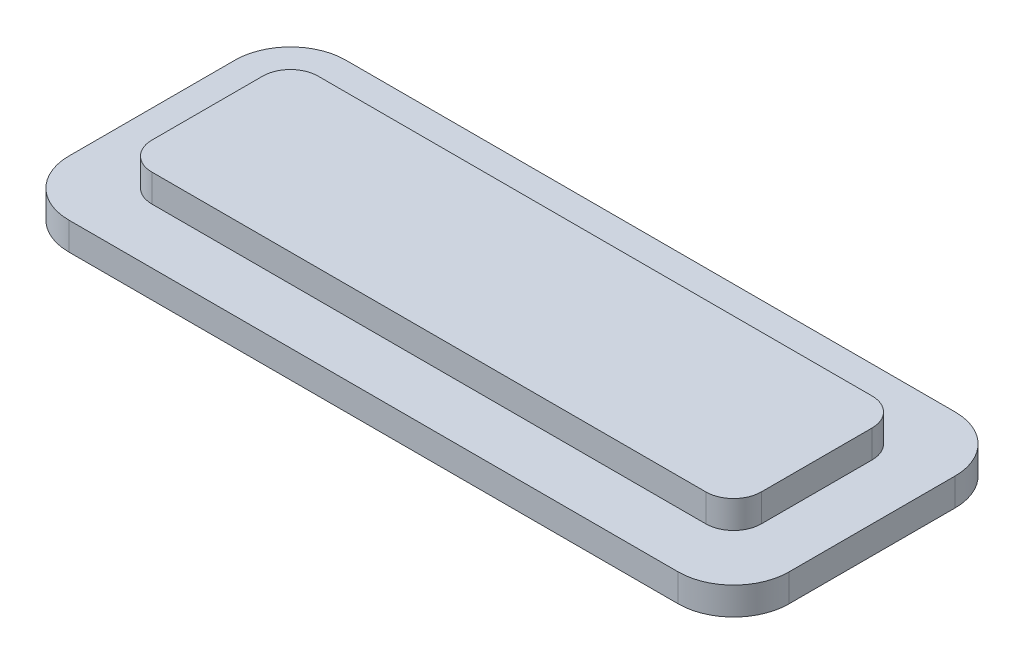
ISO-10303-21;
HEADER;
FILE_DESCRIPTION(('STEP AP214'),'2;1');
FILE_NAME('part.step','',(''),(''),'','','');
FILE_SCHEMA(('AUTOMOTIVE_DESIGN { 1 0 10303 214 1 1 1 1 }'));
ENDSEC;
DATA;
#1=APPLICATION_CONTEXT('core data for automotive mechanical design processes');
#2=APPLICATION_PROTOCOL_DEFINITION('international standard','automotive_design',2000,#1);
#3=PRODUCT_CONTEXT('',#1,'mechanical');
#4=PRODUCT('Part','Part','',(#3));
#5=PRODUCT_RELATED_PRODUCT_CATEGORY('part','',(#4));
#6=PRODUCT_DEFINITION_FORMATION('','',#4);
#7=PRODUCT_DEFINITION_CONTEXT('part definition',#1,'design');
#8=PRODUCT_DEFINITION('design','',#6,#7);
#9=PRODUCT_DEFINITION_SHAPE('','',#8);
#10=(LENGTH_UNIT() NAMED_UNIT(*) SI_UNIT(.MILLI.,.METRE.));
#11=(NAMED_UNIT(*) PLANE_ANGLE_UNIT() SI_UNIT($,.RADIAN.));
#12=(NAMED_UNIT(*) SI_UNIT($,.STERADIAN.) SOLID_ANGLE_UNIT());
#13=UNCERTAINTY_MEASURE_WITH_UNIT(LENGTH_MEASURE(1.E-05),#10,'distance_accuracy_value','');
#14=(GEOMETRIC_REPRESENTATION_CONTEXT(3) GLOBAL_UNCERTAINTY_ASSIGNED_CONTEXT((#13)) GLOBAL_UNIT_ASSIGNED_CONTEXT((#10,
#11,#12)) REPRESENTATION_CONTEXT('',''));
#15=CARTESIAN_POINT('',(0.,0.,0.));
#16=DIRECTION('',(0.,0.,1.));
#17=DIRECTION('',(1.,0.,0.));
#18=AXIS2_PLACEMENT_3D('',#15,#16,#17);
#19=CARTESIAN_POINT('',(11.,1.,3.));
#20=DIRECTION('',(0.,0.,1.));
#21=DIRECTION('',(1.,0.,0.));
#22=AXIS2_PLACEMENT_3D('',#19,#20,#21);
#23=PLANE('',#22);
#24=DIRECTION('',(-1.,0.,0.));
#25=VECTOR('',#24,1.);
#26=CARTESIAN_POINT('',(11.,0.,3.));
#27=LINE('',#26,#25);
#28=CARTESIAN_POINT('',(10.,0.,3.));
#29=VERTEX_POINT('',#28);
#30=CARTESIAN_POINT('',(-10.,0.,3.));
#31=VERTEX_POINT('',#30);
#32=EDGE_CURVE('E183',#29,#31,#27,.T.);
#33=ORIENTED_EDGE('',*,*,#32,.F.);
#34=DIRECTION('',(0.,-1.,0.));
#35=VECTOR('',#34,1.);
#36=CARTESIAN_POINT('',(10.,1.,3.));
#37=LINE('',#36,#35);
#38=CARTESIAN_POINT('',(10.,1.,3.));
#39=VERTEX_POINT('',#38);
#40=EDGE_CURVE('E249',#29,#39,#37,.F.);
#41=ORIENTED_EDGE('',*,*,#40,.T.);
#42=DIRECTION('',(-1.,0.,0.));
#43=VECTOR('',#42,1.);
#44=CARTESIAN_POINT('',(11.,1.,3.));
#45=LINE('',#44,#43);
#46=CARTESIAN_POINT('',(-10.,1.,3.));
#47=VERTEX_POINT('',#46);
#48=EDGE_CURVE('E193',#39,#47,#45,.T.);
#49=ORIENTED_EDGE('',*,*,#48,.T.);
#50=DIRECTION('',(0.,-1.,0.));
#51=VECTOR('',#50,1.);
#52=CARTESIAN_POINT('',(-10.,0.,3.));
#53=LINE('',#52,#51);
#54=EDGE_CURVE('E245',#47,#31,#53,.T.);
#55=ORIENTED_EDGE('',*,*,#54,.T.);
#56=EDGE_LOOP('',(#33,#41,#49,#55));
#57=FACE_BOUND('',#56,.T.);
#58=ADVANCED_FACE('F42',(#57),#23,.T.);
#59=CARTESIAN_POINT('',(11.,1.,-3.));
#60=DIRECTION('',(1.,0.,0.));
#61=DIRECTION('',(0.,0.,-1.));
#62=AXIS2_PLACEMENT_3D('',#59,#60,#61);
#63=PLANE('',#62);
#64=DIRECTION('',(0.,0.,1.));
#65=VECTOR('',#64,1.);
#66=CARTESIAN_POINT('',(11.,0.,-3.));
#67=LINE('',#66,#65);
#68=CARTESIAN_POINT('',(11.,0.,-2.));
#69=VERTEX_POINT('',#68);
#70=CARTESIAN_POINT('',(11.,0.,2.));
#71=VERTEX_POINT('',#70);
#72=EDGE_CURVE('E198',#69,#71,#67,.T.);
#73=ORIENTED_EDGE('',*,*,#72,.F.);
#74=DIRECTION('',(0.,-1.,0.));
#75=VECTOR('',#74,1.);
#76=CARTESIAN_POINT('',(11.,1.,-2.));
#77=LINE('',#76,#75);
#78=CARTESIAN_POINT('',(11.,1.,-2.));
#79=VERTEX_POINT('',#78);
#80=EDGE_CURVE('E230',#69,#79,#77,.F.);
#81=ORIENTED_EDGE('',*,*,#80,.T.);
#82=DIRECTION('',(0.,0.,1.));
#83=VECTOR('',#82,1.);
#84=CARTESIAN_POINT('',(11.,1.,-3.));
#85=LINE('',#84,#83);
#86=CARTESIAN_POINT('',(11.,1.,2.));
#87=VERTEX_POINT('',#86);
#88=EDGE_CURVE('E206',#79,#87,#85,.T.);
#89=ORIENTED_EDGE('',*,*,#88,.T.);
#90=DIRECTION('',(0.,-1.,0.));
#91=VECTOR('',#90,1.);
#92=CARTESIAN_POINT('',(11.,1.,2.));
#93=LINE('',#92,#91);
#94=EDGE_CURVE('E226',#87,#71,#93,.T.);
#95=ORIENTED_EDGE('',*,*,#94,.T.);
#96=EDGE_LOOP('',(#73,#81,#89,#95));
#97=FACE_BOUND('',#96,.T.);
#98=ADVANCED_FACE('F294',(#97),#63,.T.);
#99=CARTESIAN_POINT('',(11.,1.,-3.));
#100=DIRECTION('',(0.,0.,1.));
#101=DIRECTION('',(1.,0.,0.));
#102=AXIS2_PLACEMENT_3D('',#99,#100,#101);
#103=PLANE('',#102);
#104=DIRECTION('',(-1.,0.,0.));
#105=VECTOR('',#104,1.);
#106=CARTESIAN_POINT('',(11.,1.,-3.));
#107=LINE('',#106,#105);
#108=CARTESIAN_POINT('',(10.,1.,-3.));
#109=VERTEX_POINT('',#108);
#110=CARTESIAN_POINT('',(-10.,1.,-3.));
#111=VERTEX_POINT('',#110);
#112=EDGE_CURVE('E202',#109,#111,#107,.T.);
#113=ORIENTED_EDGE('',*,*,#112,.F.);
#114=DIRECTION('',(0.,-1.,0.));
#115=VECTOR('',#114,1.);
#116=CARTESIAN_POINT('',(10.,0.,-3.));
#117=LINE('',#116,#115);
#118=CARTESIAN_POINT('',(10.,0.,-3.));
#119=VERTEX_POINT('',#118);
#120=EDGE_CURVE('E222',#109,#119,#117,.T.);
#121=ORIENTED_EDGE('',*,*,#120,.T.);
#122=DIRECTION('',(-1.,0.,0.));
#123=VECTOR('',#122,1.);
#124=CARTESIAN_POINT('',(11.,0.,-3.));
#125=LINE('',#124,#123);
#126=CARTESIAN_POINT('',(-10.,0.,-3.));
#127=VERTEX_POINT('',#126);
#128=EDGE_CURVE('E213',#119,#127,#125,.T.);
#129=ORIENTED_EDGE('',*,*,#128,.T.);
#130=DIRECTION('',(0.,-1.,0.));
#131=VECTOR('',#130,1.);
#132=CARTESIAN_POINT('',(-10.,1.,-3.));
#133=LINE('',#132,#131);
#134=EDGE_CURVE('E209',#127,#111,#133,.F.);
#135=ORIENTED_EDGE('',*,*,#134,.T.);
#136=EDGE_LOOP('',(#113,#121,#129,#135));
#137=FACE_BOUND('',#136,.T.);
#138=ADVANCED_FACE('F269',(#137),#103,.F.);
#139=CARTESIAN_POINT('',(-11.,1.,-3.));
#140=DIRECTION('',(1.,0.,0.));
#141=DIRECTION('',(0.,0.,-1.));
#142=AXIS2_PLACEMENT_3D('',#139,#140,#141);
#143=PLANE('',#142);
#144=DIRECTION('',(0.,0.,1.));
#145=VECTOR('',#144,1.);
#146=CARTESIAN_POINT('',(-11.,1.,-3.));
#147=LINE('',#146,#145);
#148=CARTESIAN_POINT('',(-11.,1.,-2.));
#149=VERTEX_POINT('',#148);
#150=CARTESIAN_POINT('',(-11.,1.,2.));
#151=VERTEX_POINT('',#150);
#152=EDGE_CURVE('E197',#149,#151,#147,.T.);
#153=ORIENTED_EDGE('',*,*,#152,.F.);
#154=DIRECTION('',(0.,-1.,0.));
#155=VECTOR('',#154,1.);
#156=CARTESIAN_POINT('',(-11.,1.,-2.));
#157=LINE('',#156,#155);
#158=CARTESIAN_POINT('',(-11.,0.,-2.));
#159=VERTEX_POINT('',#158);
#160=EDGE_CURVE('E255',#149,#159,#157,.T.);
#161=ORIENTED_EDGE('',*,*,#160,.T.);
#162=DIRECTION('',(0.,0.,1.));
#163=VECTOR('',#162,1.);
#164=CARTESIAN_POINT('',(-11.,0.,-3.));
#165=LINE('',#164,#163);
#166=CARTESIAN_POINT('',(-11.,0.,2.));
#167=VERTEX_POINT('',#166);
#168=EDGE_CURVE('E187',#159,#167,#165,.T.);
#169=ORIENTED_EDGE('',*,*,#168,.T.);
#170=DIRECTION('',(0.,-1.,0.));
#171=VECTOR('',#170,1.);
#172=CARTESIAN_POINT('',(-11.,1.,2.));
#173=LINE('',#172,#171);
#174=EDGE_CURVE('E252',#167,#151,#173,.F.);
#175=ORIENTED_EDGE('',*,*,#174,.T.);
#176=EDGE_LOOP('',(#153,#161,#169,#175));
#177=FACE_BOUND('',#176,.T.);
#178=ADVANCED_FACE('F279',(#177),#143,.F.);
#179=CARTESIAN_POINT('',(0.,1.,0.));
#180=DIRECTION('',(0.,1.,0.));
#181=DIRECTION('',(0.,0.,1.));
#182=AXIS2_PLACEMENT_3D('',#179,#180,#181);
#183=PLANE('',#182);
#184=ORIENTED_EDGE('',*,*,#88,.F.);
#185=CARTESIAN_POINT('',(10.,1.,-2.));
#186=DIRECTION('',(0.,1.,0.));
#187=DIRECTION('',(0.,0.,1.));
#188=AXIS2_PLACEMENT_3D('',#185,#186,#187);
#189=CIRCLE('',#188,1.);
#190=EDGE_CURVE('E242',#79,#109,#189,.T.);
#191=ORIENTED_EDGE('',*,*,#190,.T.);
#192=ORIENTED_EDGE('',*,*,#112,.T.);
#193=CARTESIAN_POINT('',(-10.,1.,-2.));
#194=DIRECTION('',(0.,1.,0.));
#195=DIRECTION('',(0.,0.,1.));
#196=AXIS2_PLACEMENT_3D('',#193,#194,#195);
#197=CIRCLE('',#196,1.);
#198=EDGE_CURVE('E236',#111,#149,#197,.T.);
#199=ORIENTED_EDGE('',*,*,#198,.T.);
#200=ORIENTED_EDGE('',*,*,#152,.T.);
#201=CARTESIAN_POINT('',(-10.,1.,2.));
#202=DIRECTION('',(0.,1.,0.));
#203=DIRECTION('',(0.,0.,1.));
#204=AXIS2_PLACEMENT_3D('',#201,#202,#203);
#205=CIRCLE('',#204,1.);
#206=EDGE_CURVE('E233',#151,#47,#205,.T.);
#207=ORIENTED_EDGE('',*,*,#206,.T.);
#208=ORIENTED_EDGE('',*,*,#48,.F.);
#209=CARTESIAN_POINT('',(10.,1.,2.));
#210=DIRECTION('',(0.,1.,0.));
#211=DIRECTION('',(0.,0.,1.));
#212=AXIS2_PLACEMENT_3D('',#209,#210,#211);
#213=CIRCLE('',#212,1.);
#214=EDGE_CURVE('E239',#39,#87,#213,.T.);
#215=ORIENTED_EDGE('',*,*,#214,.T.);
#216=EDGE_LOOP('',(#184,#191,#192,#199,#200,#207,#208,#215));
#217=FACE_BOUND('',#216,.T.);
#218=ADVANCED_FACE('F276',(#217),#183,.T.);
#219=CARTESIAN_POINT('',(11.,-1.,3.));
#220=DIRECTION('',(0.,1.,0.));
#221=DIRECTION('',(0.,0.,1.));
#222=AXIS2_PLACEMENT_3D('',#219,#220,#221);
#223=CYLINDRICAL_SURFACE('',#222,2.);
#224=CARTESIAN_POINT('',(11.,0.,3.));
#225=DIRECTION('',(0.,-1.,0.));
#226=DIRECTION('',(0.,0.,1.));
#227=AXIS2_PLACEMENT_3D('',#224,#225,#226);
#228=CIRCLE('',#227,2.);
#229=CARTESIAN_POINT('',(13.,0.,2.99999999999999));
#230=VERTEX_POINT('',#229);
#231=CARTESIAN_POINT('',(11.,0.,5.));
#232=VERTEX_POINT('',#231);
#233=EDGE_CURVE('E181',#230,#232,#228,.T.);
#234=ORIENTED_EDGE('',*,*,#233,.T.);
#235=DIRECTION('',(0.,1.,0.));
#236=VECTOR('',#235,1.);
#237=CARTESIAN_POINT('',(11.,-1.,5.));
#238=LINE('',#237,#236);
#239=CARTESIAN_POINT('',(11.,-1.,5.));
#240=VERTEX_POINT('',#239);
#241=EDGE_CURVE('E159',#240,#232,#238,.T.);
#242=ORIENTED_EDGE('',*,*,#241,.F.);
#243=CARTESIAN_POINT('',(11.,-1.,3.));
#244=DIRECTION('',(0.,-1.,0.));
#245=DIRECTION('',(0.,0.,1.));
#246=AXIS2_PLACEMENT_3D('',#243,#244,#245);
#247=CIRCLE('',#246,2.);
#248=CARTESIAN_POINT('',(13.,-1.,2.99999999999999));
#249=VERTEX_POINT('',#248);
#250=EDGE_CURVE('E167',#249,#240,#247,.T.);
#251=ORIENTED_EDGE('',*,*,#250,.F.);
#252=DIRECTION('',(0.,1.,0.));
#253=VECTOR('',#252,1.);
#254=CARTESIAN_POINT('',(13.,-1.,2.99999999999999));
#255=LINE('',#254,#253);
#256=EDGE_CURVE('E500',#249,#230,#255,.T.);
#257=ORIENTED_EDGE('',*,*,#256,.T.);
#258=EDGE_LOOP('',(#234,#242,#251,#257));
#259=FACE_BOUND('',#258,.T.);
#260=ADVANCED_FACE('F179',(#259),#223,.T.);
#261=CARTESIAN_POINT('',(11.,-1.,5.));
#262=DIRECTION('',(0.,0.,-1.));
#263=DIRECTION('',(-1.,0.,0.));
#264=AXIS2_PLACEMENT_3D('',#261,#262,#263);
#265=PLANE('',#264);
#266=DIRECTION('',(-1.,0.,0.));
#267=VECTOR('',#266,1.);
#268=CARTESIAN_POINT('',(11.,0.,5.));
#269=LINE('',#268,#267);
#270=CARTESIAN_POINT('',(-11.,0.,5.));
#271=VERTEX_POINT('',#270);
#272=EDGE_CURVE('E510',#232,#271,#269,.T.);
#273=ORIENTED_EDGE('',*,*,#272,.T.);
#274=DIRECTION('',(0.,1.,0.));
#275=VECTOR('',#274,1.);
#276=CARTESIAN_POINT('',(-11.,-1.,5.));
#277=LINE('',#276,#275);
#278=CARTESIAN_POINT('',(-11.,-1.,5.));
#279=VERTEX_POINT('',#278);
#280=EDGE_CURVE('E162',#279,#271,#277,.T.);
#281=ORIENTED_EDGE('',*,*,#280,.F.);
#282=DIRECTION('',(-1.,0.,0.));
#283=VECTOR('',#282,1.);
#284=CARTESIAN_POINT('',(11.,-1.,5.));
#285=LINE('',#284,#283);
#286=EDGE_CURVE('E155',#240,#279,#285,.T.);
#287=ORIENTED_EDGE('',*,*,#286,.F.);
#288=ORIENTED_EDGE('',*,*,#241,.T.);
#289=EDGE_LOOP('',(#273,#281,#287,#288));
#290=FACE_BOUND('',#289,.T.);
#291=ADVANCED_FACE('F157',(#290),#265,.F.);
#292=CARTESIAN_POINT('',(-11.,-1.,3.));
#293=DIRECTION('',(0.,1.,0.));
#294=DIRECTION('',(0.,0.,1.));
#295=AXIS2_PLACEMENT_3D('',#292,#293,#294);
#296=CYLINDRICAL_SURFACE('',#295,2.);
#297=CARTESIAN_POINT('',(-11.,0.,3.));
#298=DIRECTION('',(0.,-1.,0.));
#299=DIRECTION('',(0.,0.,-1.));
#300=AXIS2_PLACEMENT_3D('',#297,#298,#299);
#301=CIRCLE('',#300,2.);
#302=CARTESIAN_POINT('',(-13.,0.,2.99999999999999));
#303=VERTEX_POINT('',#302);
#304=EDGE_CURVE('E514',#271,#303,#301,.T.);
#305=ORIENTED_EDGE('',*,*,#304,.T.);
#306=DIRECTION('',(0.,1.,0.));
#307=VECTOR('',#306,1.);
#308=CARTESIAN_POINT('',(-13.,-1.,2.99999999999999));
#309=LINE('',#308,#307);
#310=CARTESIAN_POINT('',(-13.,-1.,2.99999999999999));
#311=VERTEX_POINT('',#310);
#312=EDGE_CURVE('E189',#311,#303,#309,.T.);
#313=ORIENTED_EDGE('',*,*,#312,.F.);
#314=CARTESIAN_POINT('',(-11.,-1.,3.));
#315=DIRECTION('',(0.,-1.,0.));
#316=DIRECTION('',(0.,0.,-1.));
#317=AXIS2_PLACEMENT_3D('',#314,#315,#316);
#318=CIRCLE('',#317,2.);
#319=EDGE_CURVE('E166',#279,#311,#318,.T.);
#320=ORIENTED_EDGE('',*,*,#319,.F.);
#321=ORIENTED_EDGE('',*,*,#280,.T.);
#322=EDGE_LOOP('',(#305,#313,#320,#321));
#323=FACE_BOUND('',#322,.T.);
#324=ADVANCED_FACE('F323',(#323),#296,.T.);
#325=CARTESIAN_POINT('',(-13.,-1.,2.99999999999998));
#326=DIRECTION('',(1.,0.,0.));
#327=DIRECTION('',(0.,0.,-1.));
#328=AXIS2_PLACEMENT_3D('',#325,#326,#327);
#329=PLANE('',#328);
#330=DIRECTION('',(0.,0.,-1.));
#331=VECTOR('',#330,1.);
#332=CARTESIAN_POINT('',(-13.,0.,2.99999999999998));
#333=LINE('',#332,#331);
#334=CARTESIAN_POINT('',(-13.,0.,-2.99999999999999));
#335=VERTEX_POINT('',#334);
#336=EDGE_CURVE('E521',#303,#335,#333,.T.);
#337=ORIENTED_EDGE('',*,*,#336,.T.);
#338=DIRECTION('',(0.,1.,0.));
#339=VECTOR('',#338,1.);
#340=CARTESIAN_POINT('',(-13.,-1.,-2.99999999999999));
#341=LINE('',#340,#339);
#342=CARTESIAN_POINT('',(-13.,-1.,-2.99999999999999));
#343=VERTEX_POINT('',#342);
#344=EDGE_CURVE('E542',#343,#335,#341,.T.);
#345=ORIENTED_EDGE('',*,*,#344,.F.);
#346=DIRECTION('',(0.,0.,-1.));
#347=VECTOR('',#346,1.);
#348=CARTESIAN_POINT('',(-13.,-1.,2.99999999999998));
#349=LINE('',#348,#347);
#350=EDGE_CURVE('E551',#311,#343,#349,.T.);
#351=ORIENTED_EDGE('',*,*,#350,.F.);
#352=ORIENTED_EDGE('',*,*,#312,.T.);
#353=EDGE_LOOP('',(#337,#345,#351,#352));
#354=FACE_BOUND('',#353,.T.);
#355=ADVANCED_FACE('F326',(#354),#329,.F.);
#356=CARTESIAN_POINT('',(-11.,-1.,-3.));
#357=DIRECTION('',(0.,1.,0.));
#358=DIRECTION('',(0.,0.,1.));
#359=AXIS2_PLACEMENT_3D('',#356,#357,#358);
#360=CYLINDRICAL_SURFACE('',#359,2.);
#361=CARTESIAN_POINT('',(-11.,0.,-3.));
#362=DIRECTION('',(0.,-1.,0.));
#363=DIRECTION('',(0.,0.,1.));
#364=AXIS2_PLACEMENT_3D('',#361,#362,#363);
#365=CIRCLE('',#364,2.);
#366=CARTESIAN_POINT('',(-11.,0.,-5.));
#367=VERTEX_POINT('',#366);
#368=EDGE_CURVE('E524',#335,#367,#365,.T.);
#369=ORIENTED_EDGE('',*,*,#368,.T.);
#370=DIRECTION('',(0.,1.,0.));
#371=VECTOR('',#370,1.);
#372=CARTESIAN_POINT('',(-11.,-1.,-5.));
#373=LINE('',#372,#371);
#374=CARTESIAN_POINT('',(-11.,-1.,-5.));
#375=VERTEX_POINT('',#374);
#376=EDGE_CURVE('E538',#375,#367,#373,.T.);
#377=ORIENTED_EDGE('',*,*,#376,.F.);
#378=CARTESIAN_POINT('',(-11.,-1.,-3.));
#379=DIRECTION('',(0.,-1.,0.));
#380=DIRECTION('',(0.,0.,1.));
#381=AXIS2_PLACEMENT_3D('',#378,#379,#380);
#382=CIRCLE('',#381,2.);
#383=EDGE_CURVE('E562',#343,#375,#382,.T.);
#384=ORIENTED_EDGE('',*,*,#383,.F.);
#385=ORIENTED_EDGE('',*,*,#344,.T.);
#386=EDGE_LOOP('',(#369,#377,#384,#385));
#387=FACE_BOUND('',#386,.T.);
#388=ADVANCED_FACE('F330',(#387),#360,.T.);
#389=CARTESIAN_POINT('',(11.,-1.,-5.));
#390=DIRECTION('',(0.,0.,1.));
#391=DIRECTION('',(1.,0.,0.));
#392=AXIS2_PLACEMENT_3D('',#389,#390,#391);
#393=PLANE('',#392);
#394=DIRECTION('',(1.,0.,0.));
#395=VECTOR('',#394,1.);
#396=CARTESIAN_POINT('',(11.,0.,-5.));
#397=LINE('',#396,#395);
#398=CARTESIAN_POINT('',(11.,0.,-5.));
#399=VERTEX_POINT('',#398);
#400=EDGE_CURVE('E527',#367,#399,#397,.T.);
#401=ORIENTED_EDGE('',*,*,#400,.T.);
#402=DIRECTION('',(0.,1.,0.));
#403=VECTOR('',#402,1.);
#404=CARTESIAN_POINT('',(11.,-1.,-5.));
#405=LINE('',#404,#403);
#406=CARTESIAN_POINT('',(11.,-1.,-5.));
#407=VERTEX_POINT('',#406);
#408=EDGE_CURVE('E534',#407,#399,#405,.T.);
#409=ORIENTED_EDGE('',*,*,#408,.F.);
#410=DIRECTION('',(1.,0.,0.));
#411=VECTOR('',#410,1.);
#412=CARTESIAN_POINT('',(11.,-1.,-5.));
#413=LINE('',#412,#411);
#414=EDGE_CURVE('E558',#375,#407,#413,.T.);
#415=ORIENTED_EDGE('',*,*,#414,.F.);
#416=ORIENTED_EDGE('',*,*,#376,.T.);
#417=EDGE_LOOP('',(#401,#409,#415,#416));
#418=FACE_BOUND('',#417,.T.);
#419=ADVANCED_FACE('F334',(#418),#393,.F.);
#420=CARTESIAN_POINT('',(11.,-1.,-3.));
#421=DIRECTION('',(0.,1.,0.));
#422=DIRECTION('',(0.,0.,1.));
#423=AXIS2_PLACEMENT_3D('',#420,#421,#422);
#424=CYLINDRICAL_SURFACE('',#423,2.);
#425=CARTESIAN_POINT('',(11.,0.,-3.));
#426=DIRECTION('',(0.,-1.,0.));
#427=DIRECTION('',(0.,0.,1.));
#428=AXIS2_PLACEMENT_3D('',#425,#426,#427);
#429=CIRCLE('',#428,2.);
#430=CARTESIAN_POINT('',(13.,0.,-2.99999999999998));
#431=VERTEX_POINT('',#430);
#432=EDGE_CURVE('E505',#399,#431,#429,.T.);
#433=ORIENTED_EDGE('',*,*,#432,.T.);
#434=DIRECTION('',(0.,1.,0.));
#435=VECTOR('',#434,1.);
#436=CARTESIAN_POINT('',(13.,-1.,-2.99999999999998));
#437=LINE('',#436,#435);
#438=CARTESIAN_POINT('',(13.,-1.,-2.99999999999998));
#439=VERTEX_POINT('',#438);
#440=EDGE_CURVE('E502',#439,#431,#437,.T.);
#441=ORIENTED_EDGE('',*,*,#440,.F.);
#442=CARTESIAN_POINT('',(11.,-1.,-3.));
#443=DIRECTION('',(0.,-1.,0.));
#444=DIRECTION('',(0.,0.,1.));
#445=AXIS2_PLACEMENT_3D('',#442,#443,#444);
#446=CIRCLE('',#445,2.);
#447=EDGE_CURVE('E561',#407,#439,#446,.T.);
#448=ORIENTED_EDGE('',*,*,#447,.F.);
#449=ORIENTED_EDGE('',*,*,#408,.T.);
#450=EDGE_LOOP('',(#433,#441,#448,#449));
#451=FACE_BOUND('',#450,.T.);
#452=ADVANCED_FACE('F338',(#451),#424,.T.);
#453=CARTESIAN_POINT('',(13.,-1.,2.99999999999999));
#454=DIRECTION('',(-1.,0.,0.));
#455=DIRECTION('',(0.,0.,1.));
#456=AXIS2_PLACEMENT_3D('',#453,#454,#455);
#457=PLANE('',#456);
#458=DIRECTION('',(0.,0.,1.));
#459=VECTOR('',#458,1.);
#460=CARTESIAN_POINT('',(13.,0.,2.99999999999999));
#461=LINE('',#460,#459);
#462=EDGE_CURVE('E177',#431,#230,#461,.T.);
#463=ORIENTED_EDGE('',*,*,#462,.T.);
#464=ORIENTED_EDGE('',*,*,#256,.F.);
#465=DIRECTION('',(0.,0.,1.));
#466=VECTOR('',#465,1.);
#467=CARTESIAN_POINT('',(13.,-1.,2.99999999999999));
#468=LINE('',#467,#466);
#469=EDGE_CURVE('E172',#439,#249,#468,.T.);
#470=ORIENTED_EDGE('',*,*,#469,.F.);
#471=ORIENTED_EDGE('',*,*,#440,.T.);
#472=EDGE_LOOP('',(#463,#464,#470,#471));
#473=FACE_BOUND('',#472,.T.);
#474=ADVANCED_FACE('F342',(#473),#457,.F.);
#475=CARTESIAN_POINT('',(11.,-1.,3.));
#476=DIRECTION('',(0.,1.,0.));
#477=DIRECTION('',(0.,0.,1.));
#478=AXIS2_PLACEMENT_3D('',#475,#476,#477);
#479=PLANE('',#478);
#480=ORIENTED_EDGE('',*,*,#250,.T.);
#481=ORIENTED_EDGE('',*,*,#286,.T.);
#482=ORIENTED_EDGE('',*,*,#319,.T.);
#483=ORIENTED_EDGE('',*,*,#350,.T.);
#484=ORIENTED_EDGE('',*,*,#383,.T.);
#485=ORIENTED_EDGE('',*,*,#414,.T.);
#486=ORIENTED_EDGE('',*,*,#447,.T.);
#487=ORIENTED_EDGE('',*,*,#469,.T.);
#488=EDGE_LOOP('',(#480,#481,#482,#483,#484,#485,#486,#487));
#489=FACE_BOUND('',#488,.T.);
#490=ADVANCED_FACE('F170',(#489),#479,.F.);
#491=CARTESIAN_POINT('',(11.,0.,3.));
#492=DIRECTION('',(0.,1.,0.));
#493=DIRECTION('',(0.,0.,1.));
#494=AXIS2_PLACEMENT_3D('',#491,#492,#493);
#495=PLANE('',#494);
#496=ORIENTED_EDGE('',*,*,#128,.F.);
#497=CARTESIAN_POINT('',(10.,0.,-2.));
#498=DIRECTION('',(0.,1.,0.));
#499=DIRECTION('',(0.,0.,1.));
#500=AXIS2_PLACEMENT_3D('',#497,#498,#499);
#501=CIRCLE('',#500,1.);
#502=EDGE_CURVE('E258',#119,#69,#501,.F.);
#503=ORIENTED_EDGE('',*,*,#502,.T.);
#504=ORIENTED_EDGE('',*,*,#72,.T.);
#505=CARTESIAN_POINT('',(10.,0.,2.));
#506=DIRECTION('',(0.,1.,0.));
#507=DIRECTION('',(0.,0.,1.));
#508=AXIS2_PLACEMENT_3D('',#505,#506,#507);
#509=CIRCLE('',#508,1.);
#510=EDGE_CURVE('E261',#71,#29,#509,.F.);
#511=ORIENTED_EDGE('',*,*,#510,.T.);
#512=ORIENTED_EDGE('',*,*,#32,.T.);
#513=CARTESIAN_POINT('',(-10.,0.,2.));
#514=DIRECTION('',(0.,1.,0.));
#515=DIRECTION('',(0.,0.,1.));
#516=AXIS2_PLACEMENT_3D('',#513,#514,#515);
#517=CIRCLE('',#516,1.);
#518=EDGE_CURVE('E11',#31,#167,#517,.F.);
#519=ORIENTED_EDGE('',*,*,#518,.T.);
#520=ORIENTED_EDGE('',*,*,#168,.F.);
#521=CARTESIAN_POINT('',(-10.,0.,-2.));
#522=DIRECTION('',(0.,1.,0.));
#523=DIRECTION('',(0.,0.,1.));
#524=AXIS2_PLACEMENT_3D('',#521,#522,#523);
#525=CIRCLE('',#524,1.);
#526=EDGE_CURVE('E51',#159,#127,#525,.F.);
#527=ORIENTED_EDGE('',*,*,#526,.T.);
#528=EDGE_LOOP('',(#496,#503,#504,#511,#512,#519,#520,#527));
#529=FACE_BOUND('',#528,.T.);
#530=ORIENTED_EDGE('',*,*,#233,.F.);
#531=ORIENTED_EDGE('',*,*,#462,.F.);
#532=ORIENTED_EDGE('',*,*,#432,.F.);
#533=ORIENTED_EDGE('',*,*,#400,.F.);
#534=ORIENTED_EDGE('',*,*,#368,.F.);
#535=ORIENTED_EDGE('',*,*,#336,.F.);
#536=ORIENTED_EDGE('',*,*,#304,.F.);
#537=ORIENTED_EDGE('',*,*,#272,.F.);
#538=EDGE_LOOP('',(#530,#531,#532,#533,#534,#535,#536,#537));
#539=FACE_BOUND('',#538,.T.);
#540=ADVANCED_FACE('F265',(#529,#539),#495,.T.);
#541=CARTESIAN_POINT('',(10.,1.,-2.));
#542=DIRECTION('',(0.,1.,0.));
#543=DIRECTION('',(0.,0.,1.));
#544=AXIS2_PLACEMENT_3D('',#541,#542,#543);
#545=CYLINDRICAL_SURFACE('',#544,1.);
#546=ORIENTED_EDGE('',*,*,#190,.F.);
#547=ORIENTED_EDGE('',*,*,#80,.F.);
#548=ORIENTED_EDGE('',*,*,#502,.F.);
#549=ORIENTED_EDGE('',*,*,#120,.F.);
#550=EDGE_LOOP('',(#546,#547,#548,#549));
#551=FACE_BOUND('',#550,.T.);
#552=ADVANCED_FACE('F297',(#551),#545,.T.);
#553=CARTESIAN_POINT('',(10.,1.,2.));
#554=DIRECTION('',(0.,-1.,0.));
#555=DIRECTION('',(0.,0.,-1.));
#556=AXIS2_PLACEMENT_3D('',#553,#554,#555);
#557=CYLINDRICAL_SURFACE('',#556,1.);
#558=ORIENTED_EDGE('',*,*,#214,.F.);
#559=ORIENTED_EDGE('',*,*,#40,.F.);
#560=ORIENTED_EDGE('',*,*,#510,.F.);
#561=ORIENTED_EDGE('',*,*,#94,.F.);
#562=EDGE_LOOP('',(#558,#559,#560,#561));
#563=FACE_BOUND('',#562,.T.);
#564=ADVANCED_FACE('F289',(#563),#557,.T.);
#565=CARTESIAN_POINT('',(-10.,1.,-2.));
#566=DIRECTION('',(0.,-1.,0.));
#567=DIRECTION('',(0.,0.,-1.));
#568=AXIS2_PLACEMENT_3D('',#565,#566,#567);
#569=CYLINDRICAL_SURFACE('',#568,1.);
#570=ORIENTED_EDGE('',*,*,#198,.F.);
#571=ORIENTED_EDGE('',*,*,#134,.F.);
#572=ORIENTED_EDGE('',*,*,#526,.F.);
#573=ORIENTED_EDGE('',*,*,#160,.F.);
#574=EDGE_LOOP('',(#570,#571,#572,#573));
#575=FACE_BOUND('',#574,.T.);
#576=ADVANCED_FACE('F272',(#575),#569,.T.);
#577=CARTESIAN_POINT('',(-10.,1.,2.));
#578=DIRECTION('',(0.,1.,0.));
#579=DIRECTION('',(0.,0.,1.));
#580=AXIS2_PLACEMENT_3D('',#577,#578,#579);
#581=CYLINDRICAL_SURFACE('',#580,1.);
#582=ORIENTED_EDGE('',*,*,#206,.F.);
#583=ORIENTED_EDGE('',*,*,#174,.F.);
#584=ORIENTED_EDGE('',*,*,#518,.F.);
#585=ORIENTED_EDGE('',*,*,#54,.F.);
#586=EDGE_LOOP('',(#582,#583,#584,#585));
#587=FACE_BOUND('',#586,.T.);
#588=ADVANCED_FACE('F44',(#587),#581,.T.);
#589=CLOSED_SHELL('',(#58,#98,#138,#178,#218,#260,#291,#324,#355,#388,#419,#452,#474,#490,#540,
#552,#564,#576,#588));
#590=MANIFOLD_SOLID_BREP('B2',#589);
#591=ADVANCED_BREP_SHAPE_REPRESENTATION('',(#18,#590),#14);
#592=SHAPE_DEFINITION_REPRESENTATION(#9,#591);
ENDSEC;
END-ISO-10303-21;
